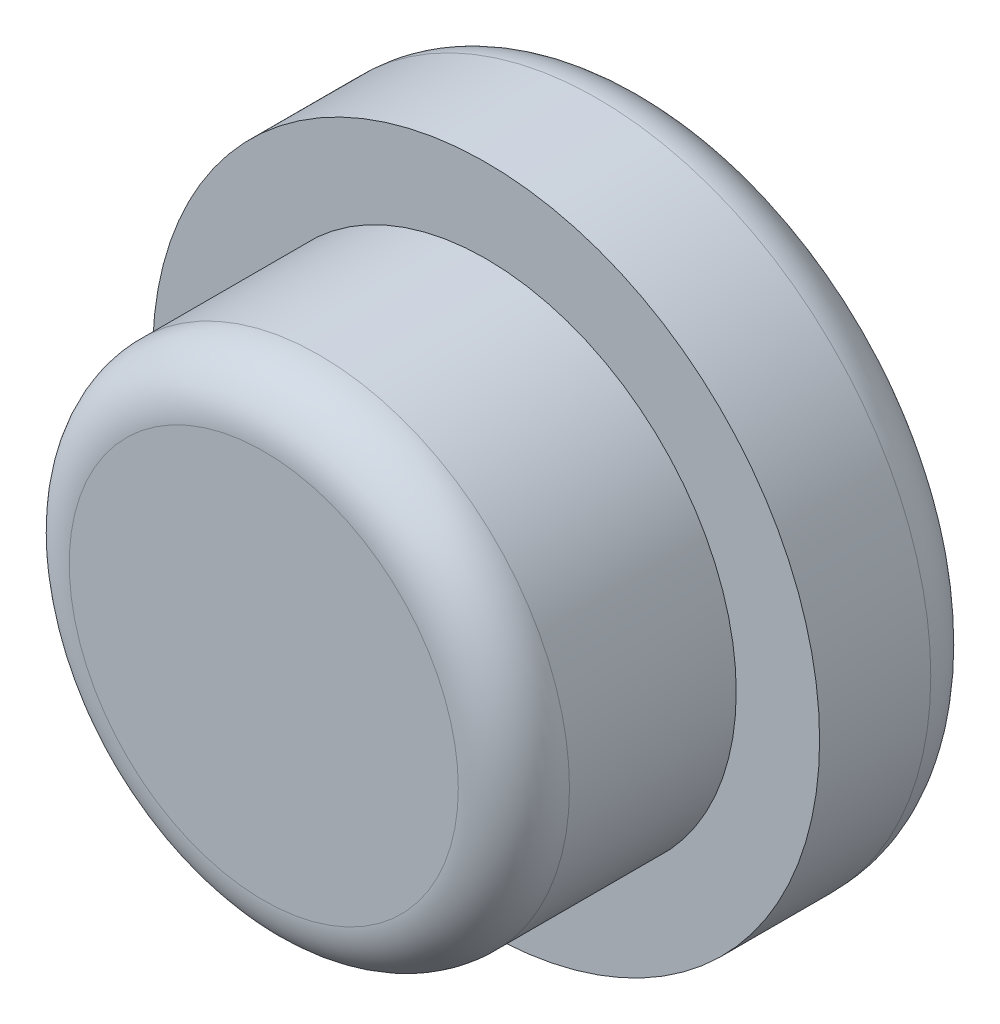
ISO-10303-21;
HEADER;
FILE_DESCRIPTION(('STEP AP214'),'2;1');
FILE_NAME('part.step','',(''),(''),'','','');
FILE_SCHEMA(('AUTOMOTIVE_DESIGN { 1 0 10303 214 1 1 1 1 }'));
ENDSEC;
DATA;
#1=APPLICATION_CONTEXT('core data for automotive mechanical design processes');
#2=APPLICATION_PROTOCOL_DEFINITION('international standard','automotive_design',2000,#1);
#3=PRODUCT_CONTEXT('',#1,'mechanical');
#4=PRODUCT('Part','Part','',(#3));
#5=PRODUCT_RELATED_PRODUCT_CATEGORY('part','',(#4));
#6=PRODUCT_DEFINITION_FORMATION('','',#4);
#7=PRODUCT_DEFINITION_CONTEXT('part definition',#1,'design');
#8=PRODUCT_DEFINITION('design','',#6,#7);
#9=PRODUCT_DEFINITION_SHAPE('','',#8);
#10=(LENGTH_UNIT() NAMED_UNIT(*) SI_UNIT(.MILLI.,.METRE.));
#11=(NAMED_UNIT(*) PLANE_ANGLE_UNIT() SI_UNIT($,.RADIAN.));
#12=(NAMED_UNIT(*) SI_UNIT($,.STERADIAN.) SOLID_ANGLE_UNIT());
#13=UNCERTAINTY_MEASURE_WITH_UNIT(LENGTH_MEASURE(1.E-05),#10,'distance_accuracy_value','');
#14=(GEOMETRIC_REPRESENTATION_CONTEXT(3) GLOBAL_UNCERTAINTY_ASSIGNED_CONTEXT((#13)) GLOBAL_UNIT_ASSIGNED_CONTEXT((#10,
#11,#12)) REPRESENTATION_CONTEXT('',''));
#15=CARTESIAN_POINT('',(0.,0.,0.));
#16=DIRECTION('',(0.,0.,1.));
#17=DIRECTION('',(1.,0.,0.));
#18=AXIS2_PLACEMENT_3D('',#15,#16,#17);
#19=CARTESIAN_POINT('',(0.,0.,1.5));
#20=DIRECTION('',(0.,0.,-1.));
#21=DIRECTION('',(-1.,0.,0.));
#22=AXIS2_PLACEMENT_3D('',#19,#20,#21);
#23=CYLINDRICAL_SURFACE('',#22,3.);
#24=CARTESIAN_POINT('',(0.,0.,0.5));
#25=DIRECTION('',(0.,0.,1.));
#26=DIRECTION('',(1.,0.,0.));
#27=AXIS2_PLACEMENT_3D('',#24,#25,#26);
#28=CIRCLE('',#27,3.);
#29=CARTESIAN_POINT('',(3.,0.,0.5));
#30=VERTEX_POINT('',#29);
#31=EDGE_CURVE('E40',#30,#30,#28,.T.);
#32=ORIENTED_EDGE('',*,*,#31,.T.);
#33=EDGE_LOOP('',(#32));
#34=FACE_BOUND('',#33,.T.);
#35=CARTESIAN_POINT('',(0.,0.,1.5));
#36=DIRECTION('',(0.,0.,1.));
#37=DIRECTION('',(1.,0.,0.));
#38=AXIS2_PLACEMENT_3D('',#35,#36,#37);
#39=CIRCLE('',#38,3.);
#40=CARTESIAN_POINT('',(3.,0.,1.5));
#41=VERTEX_POINT('',#40);
#42=EDGE_CURVE('E59',#41,#41,#39,.T.);
#43=ORIENTED_EDGE('',*,*,#42,.F.);
#44=EDGE_LOOP('',(#43));
#45=FACE_BOUND('',#44,.T.);
#46=ADVANCED_FACE('F33',(#34,#45),#23,.T.);
#47=CARTESIAN_POINT('',(0.,0.,1.5));
#48=DIRECTION('',(0.,0.,1.));
#49=DIRECTION('',(1.,0.,0.));
#50=AXIS2_PLACEMENT_3D('',#47,#48,#49);
#51=PLANE('',#50);
#52=CARTESIAN_POINT('',(0.,0.,1.5));
#53=DIRECTION('',(0.,0.,1.));
#54=DIRECTION('',(1.,0.,0.));
#55=AXIS2_PLACEMENT_3D('',#52,#53,#54);
#56=CIRCLE('',#55,2.25);
#57=CARTESIAN_POINT('',(2.25,0.,1.5));
#58=VERTEX_POINT('',#57);
#59=EDGE_CURVE('E62',#58,#58,#56,.T.);
#60=ORIENTED_EDGE('',*,*,#59,.F.);
#61=EDGE_LOOP('',(#60));
#62=FACE_BOUND('',#61,.T.);
#63=ORIENTED_EDGE('',*,*,#42,.T.);
#64=EDGE_LOOP('',(#63));
#65=FACE_BOUND('',#64,.T.);
#66=ADVANCED_FACE('F74',(#62,#65),#51,.T.);
#67=CARTESIAN_POINT('',(0.,0.,0.));
#68=DIRECTION('',(0.,0.,1.));
#69=DIRECTION('',(1.,0.,0.));
#70=AXIS2_PLACEMENT_3D('',#67,#68,#69);
#71=PLANE('',#70);
#72=CARTESIAN_POINT('',(0.,0.,0.));
#73=DIRECTION('',(0.,0.,1.));
#74=DIRECTION('',(1.,0.,0.));
#75=AXIS2_PLACEMENT_3D('',#72,#73,#74);
#76=CIRCLE('',#75,2.5);
#77=CARTESIAN_POINT('',(2.5,0.,0.));
#78=VERTEX_POINT('',#77);
#79=EDGE_CURVE('E10',#78,#78,#76,.F.);
#80=ORIENTED_EDGE('',*,*,#79,.T.);
#81=EDGE_LOOP('',(#80));
#82=FACE_BOUND('',#81,.T.);
#83=CARTESIAN_POINT('',(0.,0.,0.));
#84=DIRECTION('',(0.,0.,-1.));
#85=DIRECTION('',(-1.,0.,0.));
#86=AXIS2_PLACEMENT_3D('',#83,#84,#85);
#87=CIRCLE('',#86,1.5);
#88=CARTESIAN_POINT('',(-1.5,0.,0.));
#89=VERTEX_POINT('',#88);
#90=EDGE_CURVE('E65',#89,#89,#87,.T.);
#91=ORIENTED_EDGE('',*,*,#90,.F.);
#92=EDGE_LOOP('',(#91));
#93=FACE_BOUND('',#92,.T.);
#94=ADVANCED_FACE('F71',(#82,#93),#71,.F.);
#95=CARTESIAN_POINT('',(0.,0.,3.5));
#96=DIRECTION('',(0.,0.,-1.));
#97=DIRECTION('',(-1.,0.,0.));
#98=AXIS2_PLACEMENT_3D('',#95,#96,#97);
#99=CYLINDRICAL_SURFACE('',#98,2.25);
#100=CARTESIAN_POINT('',(0.,0.,3.));
#101=DIRECTION('',(0.,0.,1.));
#102=DIRECTION('',(1.,0.,0.));
#103=AXIS2_PLACEMENT_3D('',#100,#101,#102);
#104=CIRCLE('',#103,2.25);
#105=CARTESIAN_POINT('',(2.25,0.,3.));
#106=VERTEX_POINT('',#105);
#107=EDGE_CURVE('E44',#106,#106,#104,.F.);
#108=ORIENTED_EDGE('',*,*,#107,.T.);
#109=EDGE_LOOP('',(#108));
#110=FACE_BOUND('',#109,.T.);
#111=ORIENTED_EDGE('',*,*,#59,.T.);
#112=EDGE_LOOP('',(#111));
#113=FACE_BOUND('',#112,.T.);
#114=ADVANCED_FACE('F73',(#110,#113),#99,.T.);
#115=CARTESIAN_POINT('',(0.,0.,3.5));
#116=DIRECTION('',(0.,0.,1.));
#117=DIRECTION('',(1.,0.,0.));
#118=AXIS2_PLACEMENT_3D('',#115,#116,#117);
#119=PLANE('',#118);
#120=CARTESIAN_POINT('',(0.,0.,3.5));
#121=DIRECTION('',(0.,0.,1.));
#122=DIRECTION('',(1.,0.,0.));
#123=AXIS2_PLACEMENT_3D('',#120,#121,#122);
#124=CIRCLE('',#123,1.75);
#125=CARTESIAN_POINT('',(1.75,0.,3.5));
#126=VERTEX_POINT('',#125);
#127=EDGE_CURVE('E48',#126,#126,#124,.T.);
#128=ORIENTED_EDGE('',*,*,#127,.T.);
#129=EDGE_LOOP('',(#128));
#130=FACE_BOUND('',#129,.T.);
#131=ADVANCED_FACE('F80',(#130),#119,.T.);
#132=CARTESIAN_POINT('',(0.,0.,0.5));
#133=DIRECTION('',(0.,0.,-1.));
#134=DIRECTION('',(-1.,0.,0.));
#135=AXIS2_PLACEMENT_3D('',#132,#133,#134);
#136=CYLINDRICAL_SURFACE('',#135,1.5);
#137=CARTESIAN_POINT('',(0.,0.,0.25));
#138=DIRECTION('',(0.,0.,-1.));
#139=DIRECTION('',(-1.,0.,0.));
#140=AXIS2_PLACEMENT_3D('',#137,#138,#139);
#141=CIRCLE('',#140,1.5);
#142=CARTESIAN_POINT('',(-1.5,0.,0.25));
#143=VERTEX_POINT('',#142);
#144=EDGE_CURVE('E53',#143,#143,#141,.F.);
#145=ORIENTED_EDGE('',*,*,#144,.T.);
#146=EDGE_LOOP('',(#145));
#147=FACE_BOUND('',#146,.T.);
#148=ORIENTED_EDGE('',*,*,#90,.T.);
#149=EDGE_LOOP('',(#148));
#150=FACE_BOUND('',#149,.T.);
#151=ADVANCED_FACE('F69',(#147,#150),#136,.F.);
#152=CARTESIAN_POINT('',(0.,0.,0.5));
#153=DIRECTION('',(0.,0.,-1.));
#154=DIRECTION('',(-1.,0.,0.));
#155=AXIS2_PLACEMENT_3D('',#152,#153,#154);
#156=PLANE('',#155);
#157=CARTESIAN_POINT('',(0.,0.,0.5));
#158=DIRECTION('',(0.,0.,-1.));
#159=DIRECTION('',(-1.,0.,0.));
#160=AXIS2_PLACEMENT_3D('',#157,#158,#159);
#161=CIRCLE('',#160,1.25);
#162=CARTESIAN_POINT('',(-1.25,0.,0.5));
#163=VERTEX_POINT('',#162);
#164=EDGE_CURVE('E56',#163,#163,#161,.T.);
#165=ORIENTED_EDGE('',*,*,#164,.T.);
#166=EDGE_LOOP('',(#165));
#167=FACE_BOUND('',#166,.T.);
#168=ADVANCED_FACE('F94',(#167),#156,.T.);
#169=CARTESIAN_POINT('',(0.,0.,0.25));
#170=DIRECTION('',(0.,0.,-1.));
#171=DIRECTION('',(-1.,0.,0.));
#172=AXIS2_PLACEMENT_3D('',#169,#170,#171);
#173=TOROIDAL_SURFACE('',#172,1.25,0.25);
#174=ORIENTED_EDGE('',*,*,#144,.F.);
#175=EDGE_LOOP('',(#174));
#176=FACE_BOUND('',#175,.T.);
#177=ORIENTED_EDGE('',*,*,#164,.F.);
#178=EDGE_LOOP('',(#177));
#179=FACE_BOUND('',#178,.T.);
#180=ADVANCED_FACE('F91',(#176,#179),#173,.F.);
#181=CARTESIAN_POINT('',(0.,0.,3.));
#182=DIRECTION('',(0.,0.,1.));
#183=DIRECTION('',(1.,0.,0.));
#184=AXIS2_PLACEMENT_3D('',#181,#182,#183);
#185=TOROIDAL_SURFACE('',#184,1.75,0.5);
#186=ORIENTED_EDGE('',*,*,#107,.F.);
#187=EDGE_LOOP('',(#186));
#188=FACE_BOUND('',#187,.T.);
#189=ORIENTED_EDGE('',*,*,#127,.F.);
#190=EDGE_LOOP('',(#189));
#191=FACE_BOUND('',#190,.T.);
#192=ADVANCED_FACE('F93',(#188,#191),#185,.T.);
#193=CARTESIAN_POINT('',(0.,0.,0.5));
#194=DIRECTION('',(0.,0.,1.));
#195=DIRECTION('',(1.,0.,0.));
#196=AXIS2_PLACEMENT_3D('',#193,#194,#195);
#197=TOROIDAL_SURFACE('',#196,2.5,0.5);
#198=ORIENTED_EDGE('',*,*,#79,.F.);
#199=EDGE_LOOP('',(#198));
#200=FACE_BOUND('',#199,.T.);
#201=ORIENTED_EDGE('',*,*,#31,.F.);
#202=EDGE_LOOP('',(#201));
#203=FACE_BOUND('',#202,.T.);
#204=ADVANCED_FACE('F35',(#200,#203),#197,.T.);
#205=CLOSED_SHELL('',(#46,#66,#94,#114,#131,#151,#168,#180,#192,#204));
#206=MANIFOLD_SOLID_BREP('B2',#205);
#207=ADVANCED_BREP_SHAPE_REPRESENTATION('',(#18,#206),#14);
#208=SHAPE_DEFINITION_REPRESENTATION(#9,#207);
ENDSEC;
END-ISO-10303-21;
